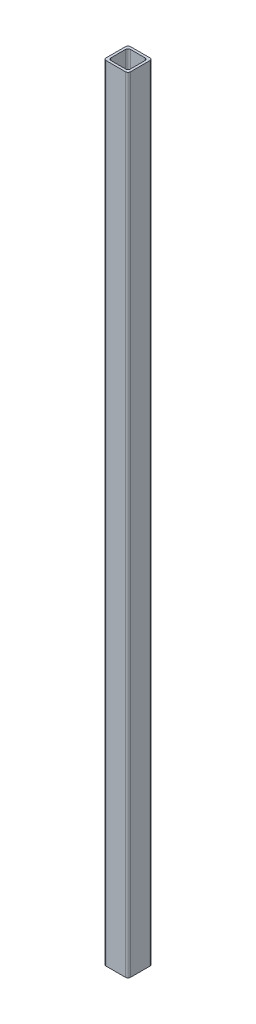
ISO-10303-21;
HEADER;
FILE_DESCRIPTION(('STEP AP214'),'2;1');
FILE_NAME('part.step','',(''),(''),'','','');
FILE_SCHEMA(('AUTOMOTIVE_DESIGN { 1 0 10303 214 1 1 1 1 }'));
ENDSEC;
DATA;
#1=APPLICATION_CONTEXT('core data for automotive mechanical design processes');
#2=APPLICATION_PROTOCOL_DEFINITION('international standard','automotive_design',2000,#1);
#3=PRODUCT_CONTEXT('',#1,'mechanical');
#4=PRODUCT('Part','Part','',(#3));
#5=PRODUCT_RELATED_PRODUCT_CATEGORY('part','',(#4));
#6=PRODUCT_DEFINITION_FORMATION('','',#4);
#7=PRODUCT_DEFINITION_CONTEXT('part definition',#1,'design');
#8=PRODUCT_DEFINITION('design','',#6,#7);
#9=PRODUCT_DEFINITION_SHAPE('','',#8);
#10=(LENGTH_UNIT() NAMED_UNIT(*) SI_UNIT(.MILLI.,.METRE.));
#11=(NAMED_UNIT(*) PLANE_ANGLE_UNIT() SI_UNIT($,.RADIAN.));
#12=(NAMED_UNIT(*) SI_UNIT($,.STERADIAN.) SOLID_ANGLE_UNIT());
#13=UNCERTAINTY_MEASURE_WITH_UNIT(LENGTH_MEASURE(1.E-05),#10,'distance_accuracy_value','');
#14=(GEOMETRIC_REPRESENTATION_CONTEXT(3) GLOBAL_UNCERTAINTY_ASSIGNED_CONTEXT((#13)) GLOBAL_UNIT_ASSIGNED_CONTEXT((#10,
#11,#12)) REPRESENTATION_CONTEXT('',''));
#15=CARTESIAN_POINT('',(0.,0.,0.));
#16=DIRECTION('',(0.,0.,1.));
#17=DIRECTION('',(1.,0.,0.));
#18=AXIS2_PLACEMENT_3D('',#15,#16,#17);
#19=CARTESIAN_POINT('',(-6.56249999999999,310.,3.78125));
#20=DIRECTION('',(0.,-1.,0.));
#21=DIRECTION('',(0.,0.,-1.));
#22=AXIS2_PLACEMENT_3D('',#19,#20,#21);
#23=CYLINDRICAL_SURFACE('',#22,1.);
#24=CARTESIAN_POINT('',(-6.56249999999999,-8.15000000000016,3.78125));
#25=DIRECTION('',(0.,-1.,0.));
#26=DIRECTION('',(0.,0.,-1.));
#27=AXIS2_PLACEMENT_3D('',#24,#25,#26);
#28=CIRCLE('',#27,1.);
#29=CARTESIAN_POINT('',(-7.56249999999999,-8.15000000000016,3.78125));
#30=VERTEX_POINT('',#29);
#31=CARTESIAN_POINT('',(-6.56249999999999,-8.15000000000016,4.78125));
#32=VERTEX_POINT('',#31);
#33=EDGE_CURVE('E665',#30,#32,#28,.F.);
#34=ORIENTED_EDGE('',*,*,#33,.F.);
#35=DIRECTION('',(0.,-1.,0.));
#36=VECTOR('',#35,1.);
#37=CARTESIAN_POINT('',(-7.56249999999999,310.,3.78125));
#38=LINE('',#37,#36);
#39=CARTESIAN_POINT('',(-7.56249999999999,314.93,3.78125));
#40=VERTEX_POINT('',#39);
#41=EDGE_CURVE('E248',#40,#30,#38,.T.);
#42=ORIENTED_EDGE('',*,*,#41,.F.);
#43=CARTESIAN_POINT('',(-6.56249999999999,314.93,3.78125));
#44=DIRECTION('',(0.,1.,0.));
#45=DIRECTION('',(0.,0.,1.));
#46=AXIS2_PLACEMENT_3D('',#43,#44,#45);
#47=CIRCLE('',#46,1.);
#48=CARTESIAN_POINT('',(-6.56249999999999,314.93,4.78125));
#49=VERTEX_POINT('',#48);
#50=EDGE_CURVE('E278',#49,#40,#47,.F.);
#51=ORIENTED_EDGE('',*,*,#50,.F.);
#52=DIRECTION('',(0.,-1.,0.));
#53=VECTOR('',#52,1.);
#54=CARTESIAN_POINT('',(-6.56249999999999,310.,4.78125));
#55=LINE('',#54,#53);
#56=EDGE_CURVE('E251',#32,#49,#55,.F.);
#57=ORIENTED_EDGE('',*,*,#56,.F.);
#58=EDGE_LOOP('',(#34,#42,#51,#57));
#59=FACE_BOUND('',#58,.T.);
#60=ADVANCED_FACE('F89',(#59),#23,.F.);
#61=CARTESIAN_POINT('',(-0.562499999999994,310.,3.78125));
#62=DIRECTION('',(0.,1.,0.));
#63=DIRECTION('',(0.,0.,1.));
#64=AXIS2_PLACEMENT_3D('',#61,#62,#63);
#65=CYLINDRICAL_SURFACE('',#64,1.);
#66=CARTESIAN_POINT('',(-0.562499999999994,-8.15000000000016,3.78125));
#67=DIRECTION('',(0.,-1.,0.));
#68=DIRECTION('',(0.,0.,-1.));
#69=AXIS2_PLACEMENT_3D('',#66,#67,#68);
#70=CIRCLE('',#69,1.);
#71=CARTESIAN_POINT('',(-0.562499999999994,-8.15000000000016,4.78125));
#72=VERTEX_POINT('',#71);
#73=CARTESIAN_POINT('',(0.437500000000006,-8.15000000000016,3.78125));
#74=VERTEX_POINT('',#73);
#75=EDGE_CURVE('E219',#72,#74,#70,.F.);
#76=ORIENTED_EDGE('',*,*,#75,.F.);
#77=DIRECTION('',(0.,-1.,0.));
#78=VECTOR('',#77,1.);
#79=CARTESIAN_POINT('',(-0.562499999999994,0.,4.78125));
#80=LINE('',#79,#78);
#81=CARTESIAN_POINT('',(-0.562499999999994,314.93,4.78125));
#82=VERTEX_POINT('',#81);
#83=EDGE_CURVE('E253',#82,#72,#80,.T.);
#84=ORIENTED_EDGE('',*,*,#83,.F.);
#85=CARTESIAN_POINT('',(-0.562499999999994,314.93,3.78125));
#86=DIRECTION('',(0.,1.,0.));
#87=DIRECTION('',(0.,0.,1.));
#88=AXIS2_PLACEMENT_3D('',#85,#86,#87);
#89=CIRCLE('',#88,1.);
#90=CARTESIAN_POINT('',(0.437500000000006,314.93,3.78125));
#91=VERTEX_POINT('',#90);
#92=EDGE_CURVE('E295',#91,#82,#89,.F.);
#93=ORIENTED_EDGE('',*,*,#92,.F.);
#94=DIRECTION('',(0.,-1.,0.));
#95=VECTOR('',#94,1.);
#96=CARTESIAN_POINT('',(0.437500000000006,310.,3.78125));
#97=LINE('',#96,#95);
#98=EDGE_CURVE('E256',#74,#91,#97,.F.);
#99=ORIENTED_EDGE('',*,*,#98,.F.);
#100=EDGE_LOOP('',(#76,#84,#93,#99));
#101=FACE_BOUND('',#100,.T.);
#102=ADVANCED_FACE('F377',(#101),#65,.F.);
#103=CARTESIAN_POINT('',(-8.56249999999999,310.,5.78125));
#104=DIRECTION('',(0.,0.,-1.));
#105=DIRECTION('',(-1.,0.,0.));
#106=AXIS2_PLACEMENT_3D('',#103,#104,#105);
#107=PLANE('',#106);
#108=DIRECTION('',(-1.,0.,0.));
#109=VECTOR('',#108,1.);
#110=CARTESIAN_POINT('',(0.,-8.15000000000017,5.78125));
#111=LINE('',#110,#109);
#112=CARTESIAN_POINT('',(0.437500000000006,-8.15000000000017,5.78125));
#113=VERTEX_POINT('',#112);
#114=CARTESIAN_POINT('',(-7.56249999999999,-8.15000000000017,5.78125));
#115=VERTEX_POINT('',#114);
#116=EDGE_CURVE('E346',#113,#115,#111,.T.);
#117=ORIENTED_EDGE('',*,*,#116,.F.);
#118=DIRECTION('',(0.,-1.,0.));
#119=VECTOR('',#118,1.);
#120=CARTESIAN_POINT('',(0.437500000000006,310.,5.78125));
#121=LINE('',#120,#119);
#122=CARTESIAN_POINT('',(0.437500000000006,314.93,5.78125));
#123=VERTEX_POINT('',#122);
#124=EDGE_CURVE('E242',#113,#123,#121,.F.);
#125=ORIENTED_EDGE('',*,*,#124,.T.);
#126=DIRECTION('',(1.,0.,0.));
#127=VECTOR('',#126,1.);
#128=CARTESIAN_POINT('',(-7.56249999999999,314.93,5.78125));
#129=LINE('',#128,#127);
#130=CARTESIAN_POINT('',(-7.56249999999999,314.93,5.78125));
#131=VERTEX_POINT('',#130);
#132=EDGE_CURVE('E324',#131,#123,#129,.T.);
#133=ORIENTED_EDGE('',*,*,#132,.F.);
#134=DIRECTION('',(0.,-1.,0.));
#135=VECTOR('',#134,1.);
#136=CARTESIAN_POINT('',(-7.56249999999999,310.,5.78125));
#137=LINE('',#136,#135);
#138=EDGE_CURVE('E239',#131,#115,#137,.T.);
#139=ORIENTED_EDGE('',*,*,#138,.T.);
#140=EDGE_LOOP('',(#117,#125,#133,#139));
#141=FACE_BOUND('',#140,.T.);
#142=ADVANCED_FACE('F345',(#141),#107,.F.);
#143=CARTESIAN_POINT('',(1.43750000000001,310.,-4.21875));
#144=DIRECTION('',(1.,0.,0.));
#145=DIRECTION('',(0.,0.,-1.));
#146=AXIS2_PLACEMENT_3D('',#143,#144,#145);
#147=PLANE('',#146);
#148=DIRECTION('',(0.,-1.,0.));
#149=VECTOR('',#148,1.);
#150=CARTESIAN_POINT('',(1.43750000000001,0.,4.78125));
#151=LINE('',#150,#149);
#152=CARTESIAN_POINT('',(1.43750000000001,314.93,4.78125));
#153=VERTEX_POINT('',#152);
#154=CARTESIAN_POINT('',(1.43750000000001,-8.15000000000017,4.78125));
#155=VERTEX_POINT('',#154);
#156=EDGE_CURVE('E231',#153,#155,#151,.T.);
#157=ORIENTED_EDGE('',*,*,#156,.T.);
#158=DIRECTION('',(0.,0.,1.));
#159=VECTOR('',#158,1.);
#160=CARTESIAN_POINT('',(1.43750000000001,-8.15000000000017,0.));
#161=LINE('',#160,#159);
#162=CARTESIAN_POINT('',(1.43750000000001,-8.15000000000017,-3.21875));
#163=VERTEX_POINT('',#162);
#164=EDGE_CURVE('E355',#163,#155,#161,.T.);
#165=ORIENTED_EDGE('',*,*,#164,.F.);
#166=DIRECTION('',(0.,-1.,0.));
#167=VECTOR('',#166,1.);
#168=CARTESIAN_POINT('',(1.43750000000001,310.,-3.21875));
#169=LINE('',#168,#167);
#170=CARTESIAN_POINT('',(1.43750000000001,314.93,-3.21875));
#171=VERTEX_POINT('',#170);
#172=EDGE_CURVE('E112',#163,#171,#169,.F.);
#173=ORIENTED_EDGE('',*,*,#172,.T.);
#174=DIRECTION('',(0.,0.,-1.));
#175=VECTOR('',#174,1.);
#176=CARTESIAN_POINT('',(1.43750000000001,314.93,4.78125));
#177=LINE('',#176,#175);
#178=EDGE_CURVE('E329',#153,#171,#177,.T.);
#179=ORIENTED_EDGE('',*,*,#178,.F.);
#180=EDGE_LOOP('',(#157,#165,#173,#179));
#181=FACE_BOUND('',#180,.T.);
#182=ADVANCED_FACE('F354',(#181),#147,.T.);
#183=CARTESIAN_POINT('',(-8.56249999999999,310.,-4.21875));
#184=DIRECTION('',(0.,0.,-1.));
#185=DIRECTION('',(-1.,0.,0.));
#186=AXIS2_PLACEMENT_3D('',#183,#184,#185);
#187=PLANE('',#186);
#188=DIRECTION('',(0.,-1.,0.));
#189=VECTOR('',#188,1.);
#190=CARTESIAN_POINT('',(0.437500000000006,310.,-4.21875));
#191=LINE('',#190,#189);
#192=CARTESIAN_POINT('',(0.437500000000006,314.93,-4.21875));
#193=VERTEX_POINT('',#192);
#194=CARTESIAN_POINT('',(0.437500000000006,-8.15000000000016,-4.21875));
#195=VERTEX_POINT('',#194);
#196=EDGE_CURVE('E244',#193,#195,#191,.T.);
#197=ORIENTED_EDGE('',*,*,#196,.T.);
#198=DIRECTION('',(1.,0.,0.));
#199=VECTOR('',#198,1.);
#200=CARTESIAN_POINT('',(0.,-8.15000000000017,-4.21875));
#201=LINE('',#200,#199);
#202=CARTESIAN_POINT('',(-7.56249999999999,-8.15000000000017,-4.21875));
#203=VERTEX_POINT('',#202);
#204=EDGE_CURVE('E104',#203,#195,#201,.T.);
#205=ORIENTED_EDGE('',*,*,#204,.F.);
#206=DIRECTION('',(0.,-1.,0.));
#207=VECTOR('',#206,1.);
#208=CARTESIAN_POINT('',(-7.5625,310.,-4.21875));
#209=LINE('',#208,#207);
#210=CARTESIAN_POINT('',(-7.5625,314.93,-4.21875));
#211=VERTEX_POINT('',#210);
#212=EDGE_CURVE('E229',#203,#211,#209,.F.);
#213=ORIENTED_EDGE('',*,*,#212,.T.);
#214=DIRECTION('',(-1.,0.,0.));
#215=VECTOR('',#214,1.);
#216=CARTESIAN_POINT('',(0.437500000000006,314.93,-4.21875));
#217=LINE('',#216,#215);
#218=EDGE_CURVE('E333',#193,#211,#217,.T.);
#219=ORIENTED_EDGE('',*,*,#218,.F.);
#220=EDGE_LOOP('',(#197,#205,#213,#219));
#221=FACE_BOUND('',#220,.T.);
#222=ADVANCED_FACE('F363',(#221),#187,.T.);
#223=CARTESIAN_POINT('',(-8.56249999999999,310.,-4.21875));
#224=DIRECTION('',(1.,0.,0.));
#225=DIRECTION('',(0.,0.,-1.));
#226=AXIS2_PLACEMENT_3D('',#223,#224,#225);
#227=PLANE('',#226);
#228=DIRECTION('',(0.,0.,-1.));
#229=VECTOR('',#228,1.);
#230=CARTESIAN_POINT('',(-8.56249999999999,-8.15000000000017,0.));
#231=LINE('',#230,#229);
#232=CARTESIAN_POINT('',(-8.56249999999999,-8.15000000000017,4.78125));
#233=VERTEX_POINT('',#232);
#234=CARTESIAN_POINT('',(-8.56249999999999,-8.15000000000017,-3.21875));
#235=VERTEX_POINT('',#234);
#236=EDGE_CURVE('E304',#233,#235,#231,.T.);
#237=ORIENTED_EDGE('',*,*,#236,.F.);
#238=DIRECTION('',(0.,-1.,0.));
#239=VECTOR('',#238,1.);
#240=CARTESIAN_POINT('',(-8.56249999999999,310.,4.78125));
#241=LINE('',#240,#239);
#242=CARTESIAN_POINT('',(-8.56249999999999,314.93,4.78125));
#243=VERTEX_POINT('',#242);
#244=EDGE_CURVE('E297',#233,#243,#241,.F.);
#245=ORIENTED_EDGE('',*,*,#244,.T.);
#246=DIRECTION('',(0.,0.,1.));
#247=VECTOR('',#246,1.);
#248=CARTESIAN_POINT('',(-8.56249999999999,314.93,-3.21875));
#249=LINE('',#248,#247);
#250=CARTESIAN_POINT('',(-8.56249999999999,314.93,-3.21875));
#251=VERTEX_POINT('',#250);
#252=EDGE_CURVE('E280',#251,#243,#249,.T.);
#253=ORIENTED_EDGE('',*,*,#252,.F.);
#254=DIRECTION('',(0.,-1.,0.));
#255=VECTOR('',#254,1.);
#256=CARTESIAN_POINT('',(-8.56249999999999,0.,-3.21875));
#257=LINE('',#256,#255);
#258=EDGE_CURVE('E233',#251,#235,#257,.T.);
#259=ORIENTED_EDGE('',*,*,#258,.T.);
#260=EDGE_LOOP('',(#237,#245,#253,#259));
#261=FACE_BOUND('',#260,.T.);
#262=ADVANCED_FACE('F303',(#261),#227,.F.);
#263=CARTESIAN_POINT('',(0.437500000000006,310.,0.));
#264=DIRECTION('',(-1.,0.,0.));
#265=DIRECTION('',(0.,0.,1.));
#266=AXIS2_PLACEMENT_3D('',#263,#264,#265);
#267=PLANE('',#266);
#268=DIRECTION('',(0.,-1.,0.));
#269=VECTOR('',#268,1.);
#270=CARTESIAN_POINT('',(0.437500000000006,310.,-2.21875));
#271=LINE('',#270,#269);
#272=CARTESIAN_POINT('',(0.437500000000006,314.93,-2.21875));
#273=VERTEX_POINT('',#272);
#274=CARTESIAN_POINT('',(0.437500000000007,-8.15000000000017,-2.21875));
#275=VERTEX_POINT('',#274);
#276=EDGE_CURVE('E208',#273,#275,#271,.T.);
#277=ORIENTED_EDGE('',*,*,#276,.T.);
#278=DIRECTION('',(0.,0.,1.));
#279=VECTOR('',#278,1.);
#280=CARTESIAN_POINT('',(0.437500000000007,-8.15000000000017,0.));
#281=LINE('',#280,#279);
#282=EDGE_CURVE('E216',#275,#74,#281,.T.);
#283=ORIENTED_EDGE('',*,*,#282,.T.);
#284=ORIENTED_EDGE('',*,*,#98,.T.);
#285=DIRECTION('',(0.,0.,-1.));
#286=VECTOR('',#285,1.);
#287=CARTESIAN_POINT('',(0.437500000000006,314.93,0.));
#288=LINE('',#287,#286);
#289=EDGE_CURVE('E228',#91,#273,#288,.T.);
#290=ORIENTED_EDGE('',*,*,#289,.T.);
#291=EDGE_LOOP('',(#277,#283,#284,#290));
#292=FACE_BOUND('',#291,.T.);
#293=ADVANCED_FACE('F226',(#292),#267,.T.);
#294=CARTESIAN_POINT('',(0.,310.,-3.21875));
#295=DIRECTION('',(0.,0.,-1.));
#296=DIRECTION('',(-1.,0.,0.));
#297=AXIS2_PLACEMENT_3D('',#294,#295,#296);
#298=PLANE('',#297);
#299=DIRECTION('',(-1.,0.,0.));
#300=VECTOR('',#299,1.);
#301=CARTESIAN_POINT('',(0.,-8.15000000000017,-3.21875));
#302=LINE('',#301,#300);
#303=CARTESIAN_POINT('',(-0.562499999999994,-8.15000000000017,-3.21875));
#304=VERTEX_POINT('',#303);
#305=CARTESIAN_POINT('',(-6.56249999999999,-8.15000000000017,-3.21875));
#306=VERTEX_POINT('',#305);
#307=EDGE_CURVE('E222',#304,#306,#302,.T.);
#308=ORIENTED_EDGE('',*,*,#307,.F.);
#309=DIRECTION('',(0.,-1.,0.));
#310=VECTOR('',#309,1.);
#311=CARTESIAN_POINT('',(-0.562499999999994,310.,-3.21875));
#312=LINE('',#311,#310);
#313=CARTESIAN_POINT('',(-0.562499999999994,314.93,-3.21875));
#314=VERTEX_POINT('',#313);
#315=EDGE_CURVE('E209',#304,#314,#312,.F.);
#316=ORIENTED_EDGE('',*,*,#315,.T.);
#317=DIRECTION('',(1.,0.,0.));
#318=VECTOR('',#317,1.);
#319=CARTESIAN_POINT('',(0.,314.93,-3.21875));
#320=LINE('',#319,#318);
#321=CARTESIAN_POINT('',(-6.56249999999999,314.93,-3.21875));
#322=VERTEX_POINT('',#321);
#323=EDGE_CURVE('E279',#322,#314,#320,.T.);
#324=ORIENTED_EDGE('',*,*,#323,.F.);
#325=DIRECTION('',(0.,-1.,0.));
#326=VECTOR('',#325,1.);
#327=CARTESIAN_POINT('',(-6.56249999999999,0.,-3.21875));
#328=LINE('',#327,#326);
#329=EDGE_CURVE('E258',#322,#306,#328,.T.);
#330=ORIENTED_EDGE('',*,*,#329,.T.);
#331=EDGE_LOOP('',(#308,#316,#324,#330));
#332=FACE_BOUND('',#331,.T.);
#333=ADVANCED_FACE('F284',(#332),#298,.F.);
#334=CARTESIAN_POINT('',(-7.56249999999999,310.,0.));
#335=DIRECTION('',(-1.,0.,0.));
#336=DIRECTION('',(0.,0.,1.));
#337=AXIS2_PLACEMENT_3D('',#334,#335,#336);
#338=PLANE('',#337);
#339=DIRECTION('',(0.,0.,1.));
#340=VECTOR('',#339,1.);
#341=CARTESIAN_POINT('',(-7.56249999999999,-8.15000000000017,0.));
#342=LINE('',#341,#340);
#343=CARTESIAN_POINT('',(-7.56249999999999,-8.15000000000017,-2.21875));
#344=VERTEX_POINT('',#343);
#345=EDGE_CURVE('E269',#344,#30,#342,.T.);
#346=ORIENTED_EDGE('',*,*,#345,.F.);
#347=DIRECTION('',(0.,-1.,0.));
#348=VECTOR('',#347,1.);
#349=CARTESIAN_POINT('',(-7.56249999999999,310.,-2.21875));
#350=LINE('',#349,#348);
#351=CARTESIAN_POINT('',(-7.56249999999999,314.93,-2.21875));
#352=VERTEX_POINT('',#351);
#353=EDGE_CURVE('E97',#344,#352,#350,.F.);
#354=ORIENTED_EDGE('',*,*,#353,.T.);
#355=DIRECTION('',(0.,0.,-1.));
#356=VECTOR('',#355,1.);
#357=CARTESIAN_POINT('',(-7.56249999999999,314.93,0.));
#358=LINE('',#357,#356);
#359=EDGE_CURVE('E266',#40,#352,#358,.T.);
#360=ORIENTED_EDGE('',*,*,#359,.F.);
#361=ORIENTED_EDGE('',*,*,#41,.T.);
#362=EDGE_LOOP('',(#346,#354,#360,#361));
#363=FACE_BOUND('',#362,.T.);
#364=ADVANCED_FACE('F265',(#363),#338,.F.);
#365=CARTESIAN_POINT('',(0.,310.,4.78125));
#366=DIRECTION('',(0.,0.,-1.));
#367=DIRECTION('',(-1.,0.,0.));
#368=AXIS2_PLACEMENT_3D('',#365,#366,#367);
#369=PLANE('',#368);
#370=ORIENTED_EDGE('',*,*,#83,.T.);
#371=DIRECTION('',(1.,0.,0.));
#372=VECTOR('',#371,1.);
#373=CARTESIAN_POINT('',(0.,-8.15000000000017,4.78125));
#374=LINE('',#373,#372);
#375=EDGE_CURVE('E223',#32,#72,#374,.T.);
#376=ORIENTED_EDGE('',*,*,#375,.F.);
#377=ORIENTED_EDGE('',*,*,#56,.T.);
#378=DIRECTION('',(1.,0.,0.));
#379=VECTOR('',#378,1.);
#380=CARTESIAN_POINT('',(0.,314.93,4.78125));
#381=LINE('',#380,#379);
#382=EDGE_CURVE('E291',#49,#82,#381,.T.);
#383=ORIENTED_EDGE('',*,*,#382,.T.);
#384=EDGE_LOOP('',(#370,#376,#377,#383));
#385=FACE_BOUND('',#384,.T.);
#386=ADVANCED_FACE('F395',(#385),#369,.T.);
#387=CARTESIAN_POINT('',(-7.5625,310.,-3.21875));
#388=DIRECTION('',(0.,1.,0.));
#389=DIRECTION('',(0.,0.,1.));
#390=AXIS2_PLACEMENT_3D('',#387,#388,#389);
#391=CYLINDRICAL_SURFACE('',#390,1.);
#392=ORIENTED_EDGE('',*,*,#212,.F.);
#393=CARTESIAN_POINT('',(-7.56249999999999,-8.15000000000017,-3.21875));
#394=DIRECTION('',(0.,-1.,0.));
#395=DIRECTION('',(0.,0.,-1.));
#396=AXIS2_PLACEMENT_3D('',#393,#394,#395);
#397=CIRCLE('',#396,1.);
#398=EDGE_CURVE('E313',#235,#203,#397,.T.);
#399=ORIENTED_EDGE('',*,*,#398,.F.);
#400=ORIENTED_EDGE('',*,*,#258,.F.);
#401=CARTESIAN_POINT('',(-7.5625,314.93,-3.21875));
#402=DIRECTION('',(0.,1.,0.));
#403=DIRECTION('',(0.,0.,1.));
#404=AXIS2_PLACEMENT_3D('',#401,#402,#403);
#405=CIRCLE('',#404,1.);
#406=EDGE_CURVE('E312',#211,#251,#405,.T.);
#407=ORIENTED_EDGE('',*,*,#406,.F.);
#408=EDGE_LOOP('',(#392,#399,#400,#407));
#409=FACE_BOUND('',#408,.T.);
#410=ADVANCED_FACE('F311',(#409),#391,.T.);
#411=CARTESIAN_POINT('',(0.437500000000006,310.,4.78125));
#412=DIRECTION('',(0.,1.,0.));
#413=DIRECTION('',(0.,0.,1.));
#414=AXIS2_PLACEMENT_3D('',#411,#412,#413);
#415=CYLINDRICAL_SURFACE('',#414,1.);
#416=ORIENTED_EDGE('',*,*,#124,.F.);
#417=CARTESIAN_POINT('',(0.437500000000004,-8.15000000000017,4.78124999999999));
#418=DIRECTION('',(0.,-1.,0.));
#419=DIRECTION('',(0.,0.,-1.));
#420=AXIS2_PLACEMENT_3D('',#417,#418,#419);
#421=CIRCLE('',#420,1.);
#422=EDGE_CURVE('E353',#155,#113,#421,.T.);
#423=ORIENTED_EDGE('',*,*,#422,.F.);
#424=ORIENTED_EDGE('',*,*,#156,.F.);
#425=CARTESIAN_POINT('',(0.437500000000006,314.93,4.78125));
#426=DIRECTION('',(0.,1.,0.));
#427=DIRECTION('',(0.,0.,1.));
#428=AXIS2_PLACEMENT_3D('',#425,#426,#427);
#429=CIRCLE('',#428,0.999999999999999);
#430=EDGE_CURVE('E327',#123,#153,#429,.T.);
#431=ORIENTED_EDGE('',*,*,#430,.F.);
#432=EDGE_LOOP('',(#416,#423,#424,#431));
#433=FACE_BOUND('',#432,.T.);
#434=ADVANCED_FACE('F351',(#433),#415,.T.);
#435=CARTESIAN_POINT('',(-7.56249999999999,310.,4.78125));
#436=DIRECTION('',(0.,-1.,0.));
#437=DIRECTION('',(0.,0.,-1.));
#438=AXIS2_PLACEMENT_3D('',#435,#436,#437);
#439=CYLINDRICAL_SURFACE('',#438,1.);
#440=ORIENTED_EDGE('',*,*,#244,.F.);
#441=CARTESIAN_POINT('',(-7.56249999999999,-8.15000000000017,4.78125));
#442=DIRECTION('',(0.,-1.,0.));
#443=DIRECTION('',(0.,0.,-1.));
#444=AXIS2_PLACEMENT_3D('',#441,#442,#443);
#445=CIRCLE('',#444,1.);
#446=EDGE_CURVE('E316',#115,#233,#445,.T.);
#447=ORIENTED_EDGE('',*,*,#446,.F.);
#448=ORIENTED_EDGE('',*,*,#138,.F.);
#449=CARTESIAN_POINT('',(-7.56249999999999,314.93,4.78125));
#450=DIRECTION('',(0.,1.,0.));
#451=DIRECTION('',(0.,0.,1.));
#452=AXIS2_PLACEMENT_3D('',#449,#450,#451);
#453=CIRCLE('',#452,1.);
#454=EDGE_CURVE('E322',#243,#131,#453,.T.);
#455=ORIENTED_EDGE('',*,*,#454,.F.);
#456=EDGE_LOOP('',(#440,#447,#448,#455));
#457=FACE_BOUND('',#456,.T.);
#458=ADVANCED_FACE('F341',(#457),#439,.T.);
#459=CARTESIAN_POINT('',(0.437500000000006,310.,-3.21875));
#460=DIRECTION('',(0.,-1.,0.));
#461=DIRECTION('',(0.,0.,-1.));
#462=AXIS2_PLACEMENT_3D('',#459,#460,#461);
#463=CYLINDRICAL_SURFACE('',#462,1.);
#464=ORIENTED_EDGE('',*,*,#172,.F.);
#465=CARTESIAN_POINT('',(0.437500000000007,-8.15000000000017,-3.21875000000001));
#466=DIRECTION('',(0.,-1.,0.));
#467=DIRECTION('',(0.,0.,-1.));
#468=AXIS2_PLACEMENT_3D('',#465,#466,#467);
#469=CIRCLE('',#468,0.999999999999998);
#470=EDGE_CURVE('E361',#195,#163,#469,.T.);
#471=ORIENTED_EDGE('',*,*,#470,.F.);
#472=ORIENTED_EDGE('',*,*,#196,.F.);
#473=CARTESIAN_POINT('',(0.437500000000006,314.93,-3.21875));
#474=DIRECTION('',(0.,1.,0.));
#475=DIRECTION('',(0.,0.,1.));
#476=AXIS2_PLACEMENT_3D('',#473,#474,#475);
#477=CIRCLE('',#476,1.);
#478=EDGE_CURVE('E331',#171,#193,#477,.T.);
#479=ORIENTED_EDGE('',*,*,#478,.F.);
#480=EDGE_LOOP('',(#464,#471,#472,#479));
#481=FACE_BOUND('',#480,.T.);
#482=ADVANCED_FACE('F360',(#481),#463,.T.);
#483=CARTESIAN_POINT('',(-0.562499999999994,310.,-2.21875));
#484=DIRECTION('',(0.,-1.,0.));
#485=DIRECTION('',(0.,0.,-1.));
#486=AXIS2_PLACEMENT_3D('',#483,#484,#485);
#487=CYLINDRICAL_SURFACE('',#486,1.);
#488=ORIENTED_EDGE('',*,*,#315,.F.);
#489=CARTESIAN_POINT('',(-0.562499999999994,-8.15000000000016,-2.21875));
#490=DIRECTION('',(0.,1.,0.));
#491=DIRECTION('',(0.,0.,1.));
#492=AXIS2_PLACEMENT_3D('',#489,#490,#491);
#493=CIRCLE('',#492,1.);
#494=EDGE_CURVE('E203',#304,#275,#493,.F.);
#495=ORIENTED_EDGE('',*,*,#494,.T.);
#496=ORIENTED_EDGE('',*,*,#276,.F.);
#497=CARTESIAN_POINT('',(-0.562499999999994,314.93,-2.21875));
#498=DIRECTION('',(0.,1.,0.));
#499=DIRECTION('',(0.,0.,1.));
#500=AXIS2_PLACEMENT_3D('',#497,#498,#499);
#501=CIRCLE('',#500,1.);
#502=EDGE_CURVE('E286',#314,#273,#501,.F.);
#503=ORIENTED_EDGE('',*,*,#502,.F.);
#504=EDGE_LOOP('',(#488,#495,#496,#503));
#505=FACE_BOUND('',#504,.T.);
#506=ADVANCED_FACE('F205',(#505),#487,.F.);
#507=CARTESIAN_POINT('',(-6.56249999999999,310.,-2.21875));
#508=DIRECTION('',(0.,1.,0.));
#509=DIRECTION('',(0.,0.,1.));
#510=AXIS2_PLACEMENT_3D('',#507,#508,#509);
#511=CYLINDRICAL_SURFACE('',#510,1.);
#512=ORIENTED_EDGE('',*,*,#353,.F.);
#513=CARTESIAN_POINT('',(-6.56249999999999,-8.15000000000016,-2.21875));
#514=DIRECTION('',(0.,1.,0.));
#515=DIRECTION('',(0.,0.,1.));
#516=AXIS2_PLACEMENT_3D('',#513,#514,#515);
#517=CIRCLE('',#516,1.);
#518=EDGE_CURVE('E213',#344,#306,#517,.F.);
#519=ORIENTED_EDGE('',*,*,#518,.T.);
#520=ORIENTED_EDGE('',*,*,#329,.F.);
#521=CARTESIAN_POINT('',(-6.56249999999999,314.93,-2.21875));
#522=DIRECTION('',(0.,1.,0.));
#523=DIRECTION('',(0.,0.,1.));
#524=AXIS2_PLACEMENT_3D('',#521,#522,#523);
#525=CIRCLE('',#524,1.);
#526=EDGE_CURVE('E12',#352,#322,#525,.F.);
#527=ORIENTED_EDGE('',*,*,#526,.F.);
#528=EDGE_LOOP('',(#512,#519,#520,#527));
#529=FACE_BOUND('',#528,.T.);
#530=ADVANCED_FACE('F91',(#529),#511,.F.);
#531=CARTESIAN_POINT('',(-7.56249999999999,314.93,4.78125));
#532=DIRECTION('',(0.,1.,0.));
#533=DIRECTION('',(0.,0.,1.));
#534=AXIS2_PLACEMENT_3D('',#531,#532,#533);
#535=PLANE('',#534);
#536=ORIENTED_EDGE('',*,*,#454,.T.);
#537=ORIENTED_EDGE('',*,*,#132,.T.);
#538=ORIENTED_EDGE('',*,*,#430,.T.);
#539=ORIENTED_EDGE('',*,*,#178,.T.);
#540=ORIENTED_EDGE('',*,*,#478,.T.);
#541=ORIENTED_EDGE('',*,*,#218,.T.);
#542=ORIENTED_EDGE('',*,*,#406,.T.);
#543=ORIENTED_EDGE('',*,*,#252,.T.);
#544=EDGE_LOOP('',(#536,#537,#538,#539,#540,#541,#542,#543));
#545=FACE_BOUND('',#544,.T.);
#546=ORIENTED_EDGE('',*,*,#92,.T.);
#547=ORIENTED_EDGE('',*,*,#382,.F.);
#548=ORIENTED_EDGE('',*,*,#50,.T.);
#549=ORIENTED_EDGE('',*,*,#359,.T.);
#550=ORIENTED_EDGE('',*,*,#526,.T.);
#551=ORIENTED_EDGE('',*,*,#323,.T.);
#552=ORIENTED_EDGE('',*,*,#502,.T.);
#553=ORIENTED_EDGE('',*,*,#289,.F.);
#554=EDGE_LOOP('',(#546,#547,#548,#549,#550,#551,#552,#553));
#555=FACE_BOUND('',#554,.T.);
#556=ADVANCED_FACE('F273',(#545,#555),#535,.T.);
#557=CARTESIAN_POINT('',(0.,-8.15000000000017,0.));
#558=DIRECTION('',(0.,-1.,0.));
#559=DIRECTION('',(0.,0.,-1.));
#560=AXIS2_PLACEMENT_3D('',#557,#558,#559);
#561=PLANE('',#560);
#562=ORIENTED_EDGE('',*,*,#518,.F.);
#563=ORIENTED_EDGE('',*,*,#345,.T.);
#564=ORIENTED_EDGE('',*,*,#33,.T.);
#565=ORIENTED_EDGE('',*,*,#375,.T.);
#566=ORIENTED_EDGE('',*,*,#75,.T.);
#567=ORIENTED_EDGE('',*,*,#282,.F.);
#568=ORIENTED_EDGE('',*,*,#494,.F.);
#569=ORIENTED_EDGE('',*,*,#307,.T.);
#570=EDGE_LOOP('',(#562,#563,#564,#565,#566,#567,#568,#569));
#571=FACE_BOUND('',#570,.T.);
#572=ORIENTED_EDGE('',*,*,#236,.T.);
#573=ORIENTED_EDGE('',*,*,#398,.T.);
#574=ORIENTED_EDGE('',*,*,#204,.T.);
#575=ORIENTED_EDGE('',*,*,#470,.T.);
#576=ORIENTED_EDGE('',*,*,#164,.T.);
#577=ORIENTED_EDGE('',*,*,#422,.T.);
#578=ORIENTED_EDGE('',*,*,#116,.T.);
#579=ORIENTED_EDGE('',*,*,#446,.T.);
#580=EDGE_LOOP('',(#572,#573,#574,#575,#576,#577,#578,#579));
#581=FACE_BOUND('',#580,.T.);
#582=ADVANCED_FACE('F217',(#571,#581),#561,.T.);
#583=CLOSED_SHELL('',(#60,#102,#142,#182,#222,#262,#293,#333,#364,#386,#410,#434,#458,#482,#506,
#530,#556,#582));
#584=MANIFOLD_SOLID_BREP('B2',#583);
#585=ADVANCED_BREP_SHAPE_REPRESENTATION('',(#18,#584),#14);
#586=SHAPE_DEFINITION_REPRESENTATION(#9,#585);
ENDSEC;
END-ISO-10303-21;
